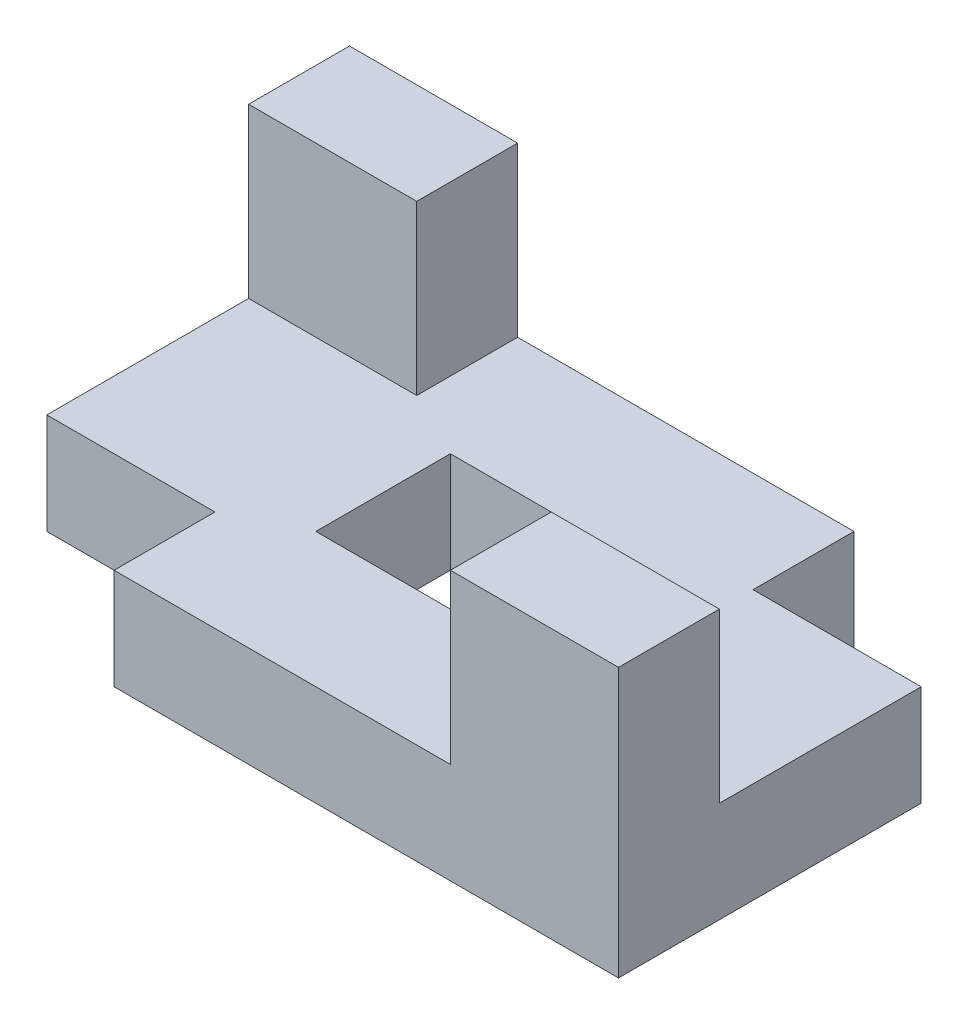
ISO-10303-21;
HEADER;
FILE_DESCRIPTION(('STEP AP214'),'2;1');
FILE_NAME('part.step','',(''),(''),'','','');
FILE_SCHEMA(('AUTOMOTIVE_DESIGN { 1 0 10303 214 1 1 1 1 }'));
ENDSEC;
DATA;
#1=APPLICATION_CONTEXT('core data for automotive mechanical design processes');
#2=APPLICATION_PROTOCOL_DEFINITION('international standard','automotive_design',2000,#1);
#3=PRODUCT_CONTEXT('',#1,'mechanical');
#4=PRODUCT('Part','Part','',(#3));
#5=PRODUCT_RELATED_PRODUCT_CATEGORY('part','',(#4));
#6=PRODUCT_DEFINITION_FORMATION('','',#4);
#7=PRODUCT_DEFINITION_CONTEXT('part definition',#1,'design');
#8=PRODUCT_DEFINITION('design','',#6,#7);
#9=PRODUCT_DEFINITION_SHAPE('','',#8);
#10=(LENGTH_UNIT() NAMED_UNIT(*) SI_UNIT(.MILLI.,.METRE.));
#11=(NAMED_UNIT(*) PLANE_ANGLE_UNIT() SI_UNIT($,.RADIAN.));
#12=(NAMED_UNIT(*) SI_UNIT($,.STERADIAN.) SOLID_ANGLE_UNIT());
#13=UNCERTAINTY_MEASURE_WITH_UNIT(LENGTH_MEASURE(1.E-05),#10,'distance_accuracy_value','');
#14=(GEOMETRIC_REPRESENTATION_CONTEXT(3) GLOBAL_UNCERTAINTY_ASSIGNED_CONTEXT((#13)) GLOBAL_UNIT_ASSIGNED_CONTEXT((#10,
#11,#12)) REPRESENTATION_CONTEXT('',''));
#15=CARTESIAN_POINT('',(0.,0.,0.));
#16=DIRECTION('',(0.,0.,1.));
#17=DIRECTION('',(1.,0.,0.));
#18=AXIS2_PLACEMENT_3D('',#15,#16,#17);
#19=CARTESIAN_POINT('',(50.,15.,0.));
#20=DIRECTION('',(-1.,0.,0.));
#21=DIRECTION('',(0.,0.,1.));
#22=AXIS2_PLACEMENT_3D('',#19,#20,#21);
#23=PLANE('',#22);
#24=DIRECTION('',(0.,0.,-1.));
#25=VECTOR('',#24,1.);
#26=CARTESIAN_POINT('',(50.,0.,0.));
#27=LINE('',#26,#25);
#28=CARTESIAN_POINT('',(50.,0.,30.));
#29=VERTEX_POINT('',#28);
#30=CARTESIAN_POINT('',(50.,0.,-15.));
#31=VERTEX_POINT('',#30);
#32=EDGE_CURVE('E196',#29,#31,#27,.T.);
#33=ORIENTED_EDGE('',*,*,#32,.T.);
#34=DIRECTION('',(0.,-1.,0.));
#35=VECTOR('',#34,1.);
#36=CARTESIAN_POINT('',(50.,15.,-15.));
#37=LINE('',#36,#35);
#38=CARTESIAN_POINT('',(50.,15.,-15.));
#39=VERTEX_POINT('',#38);
#40=EDGE_CURVE('E11',#39,#31,#37,.T.);
#41=ORIENTED_EDGE('',*,*,#40,.F.);
#42=DIRECTION('',(0.,0.,-1.));
#43=VECTOR('',#42,1.);
#44=CARTESIAN_POINT('',(50.,15.,0.));
#45=LINE('',#44,#43);
#46=CARTESIAN_POINT('',(50.,15.,15.));
#47=VERTEX_POINT('',#46);
#48=EDGE_CURVE('E274',#47,#39,#45,.T.);
#49=ORIENTED_EDGE('',*,*,#48,.F.);
#50=DIRECTION('',(0.,-1.,0.));
#51=VECTOR('',#50,1.);
#52=CARTESIAN_POINT('',(50.,40.,15.));
#53=LINE('',#52,#51);
#54=CARTESIAN_POINT('',(50.,40.,15.));
#55=VERTEX_POINT('',#54);
#56=EDGE_CURVE('E616',#55,#47,#53,.T.);
#57=ORIENTED_EDGE('',*,*,#56,.F.);
#58=DIRECTION('',(0.,0.,-1.));
#59=VECTOR('',#58,1.);
#60=CARTESIAN_POINT('',(50.,40.,0.));
#61=LINE('',#60,#59);
#62=CARTESIAN_POINT('',(50.,40.,30.));
#63=VERTEX_POINT('',#62);
#64=EDGE_CURVE('E564',#63,#55,#61,.T.);
#65=ORIENTED_EDGE('',*,*,#64,.F.);
#66=DIRECTION('',(0.,-1.,0.));
#67=VECTOR('',#66,1.);
#68=CARTESIAN_POINT('',(50.,40.,30.));
#69=LINE('',#68,#67);
#70=EDGE_CURVE('E583',#63,#29,#69,.T.);
#71=ORIENTED_EDGE('',*,*,#70,.T.);
#72=EDGE_LOOP('',(#33,#41,#49,#57,#65,#71));
#73=FACE_BOUND('',#72,.T.);
#74=ADVANCED_FACE('F45',(#73),#23,.F.);
#75=CARTESIAN_POINT('',(0.,15.,-15.));
#76=DIRECTION('',(0.,0.,1.));
#77=DIRECTION('',(1.,0.,0.));
#78=AXIS2_PLACEMENT_3D('',#75,#76,#77);
#79=PLANE('',#78);
#80=DIRECTION('',(-1.,0.,0.));
#81=VECTOR('',#80,1.);
#82=CARTESIAN_POINT('',(0.,0.,-15.));
#83=LINE('',#82,#81);
#84=CARTESIAN_POINT('',(25.,0.,-15.));
#85=VERTEX_POINT('',#84);
#86=EDGE_CURVE('E200',#31,#85,#83,.T.);
#87=ORIENTED_EDGE('',*,*,#86,.T.);
#88=DIRECTION('',(0.,-1.,0.));
#89=VECTOR('',#88,1.);
#90=CARTESIAN_POINT('',(25.,15.,-15.));
#91=LINE('',#90,#89);
#92=CARTESIAN_POINT('',(25.,15.,-15.));
#93=VERTEX_POINT('',#92);
#94=EDGE_CURVE('E56',#93,#85,#91,.T.);
#95=ORIENTED_EDGE('',*,*,#94,.F.);
#96=DIRECTION('',(-1.,0.,0.));
#97=VECTOR('',#96,1.);
#98=CARTESIAN_POINT('',(0.,15.,-15.));
#99=LINE('',#98,#97);
#100=EDGE_CURVE('E278',#39,#93,#99,.T.);
#101=ORIENTED_EDGE('',*,*,#100,.F.);
#102=ORIENTED_EDGE('',*,*,#40,.T.);
#103=EDGE_LOOP('',(#87,#95,#101,#102));
#104=FACE_BOUND('',#103,.T.);
#105=ADVANCED_FACE('F348',(#104),#79,.F.);
#106=CARTESIAN_POINT('',(25.,15.,0.));
#107=DIRECTION('',(1.,0.,0.));
#108=DIRECTION('',(0.,0.,-1.));
#109=AXIS2_PLACEMENT_3D('',#106,#107,#108);
#110=PLANE('',#109);
#111=DIRECTION('',(0.,0.,1.));
#112=VECTOR('',#111,1.);
#113=CARTESIAN_POINT('',(25.,0.,0.));
#114=LINE('',#113,#112);
#115=CARTESIAN_POINT('',(25.,0.,-30.));
#116=VERTEX_POINT('',#115);
#117=EDGE_CURVE('E204',#116,#85,#114,.T.);
#118=ORIENTED_EDGE('',*,*,#117,.F.);
#119=DIRECTION('',(0.,-1.,0.));
#120=VECTOR('',#119,1.);
#121=CARTESIAN_POINT('',(25.,15.,-30.));
#122=LINE('',#121,#120);
#123=CARTESIAN_POINT('',(25.,15.,-30.));
#124=VERTEX_POINT('',#123);
#125=EDGE_CURVE('E151',#124,#116,#122,.T.);
#126=ORIENTED_EDGE('',*,*,#125,.F.);
#127=DIRECTION('',(0.,0.,1.));
#128=VECTOR('',#127,1.);
#129=CARTESIAN_POINT('',(25.,15.,0.));
#130=LINE('',#129,#128);
#131=EDGE_CURVE('E281',#124,#93,#130,.T.);
#132=ORIENTED_EDGE('',*,*,#131,.T.);
#133=ORIENTED_EDGE('',*,*,#94,.T.);
#134=EDGE_LOOP('',(#118,#126,#132,#133));
#135=FACE_BOUND('',#134,.T.);
#136=ADVANCED_FACE('F315',(#135),#110,.T.);
#137=CARTESIAN_POINT('',(0.,15.,-30.));
#138=DIRECTION('',(0.,0.,-1.));
#139=DIRECTION('',(-1.,0.,0.));
#140=AXIS2_PLACEMENT_3D('',#137,#138,#139);
#141=PLANE('',#140);
#142=DIRECTION('',(1.,0.,0.));
#143=VECTOR('',#142,1.);
#144=CARTESIAN_POINT('',(0.,0.,-30.));
#145=LINE('',#144,#143);
#146=CARTESIAN_POINT('',(-50.,0.,-30.));
#147=VERTEX_POINT('',#146);
#148=EDGE_CURVE('E208',#147,#116,#145,.T.);
#149=ORIENTED_EDGE('',*,*,#148,.F.);
#150=DIRECTION('',(0.,-1.,0.));
#151=VECTOR('',#150,1.);
#152=CARTESIAN_POINT('',(-50.,40.,-30.));
#153=LINE('',#152,#151);
#154=CARTESIAN_POINT('',(-50.,40.,-30.));
#155=VERTEX_POINT('',#154);
#156=EDGE_CURVE('E309',#155,#147,#153,.T.);
#157=ORIENTED_EDGE('',*,*,#156,.F.);
#158=DIRECTION('',(1.,0.,0.));
#159=VECTOR('',#158,1.);
#160=CARTESIAN_POINT('',(0.,40.,-30.));
#161=LINE('',#160,#159);
#162=CARTESIAN_POINT('',(-25.,40.,-30.));
#163=VERTEX_POINT('',#162);
#164=EDGE_CURVE('E307',#155,#163,#161,.T.);
#165=ORIENTED_EDGE('',*,*,#164,.T.);
#166=DIRECTION('',(0.,-1.,0.));
#167=VECTOR('',#166,1.);
#168=CARTESIAN_POINT('',(-25.,40.,-30.));
#169=LINE('',#168,#167);
#170=CARTESIAN_POINT('',(-25.,15.,-30.));
#171=VERTEX_POINT('',#170);
#172=EDGE_CURVE('E298',#163,#171,#169,.T.);
#173=ORIENTED_EDGE('',*,*,#172,.T.);
#174=DIRECTION('',(1.,0.,0.));
#175=VECTOR('',#174,1.);
#176=CARTESIAN_POINT('',(0.,15.,-30.));
#177=LINE('',#176,#175);
#178=EDGE_CURVE('E285',#171,#124,#177,.T.);
#179=ORIENTED_EDGE('',*,*,#178,.T.);
#180=ORIENTED_EDGE('',*,*,#125,.T.);
#181=EDGE_LOOP('',(#149,#157,#165,#173,#179,#180));
#182=FACE_BOUND('',#181,.T.);
#183=ADVANCED_FACE('F304',(#182),#141,.T.);
#184=CARTESIAN_POINT('',(-50.,15.,0.));
#185=DIRECTION('',(-1.,0.,0.));
#186=DIRECTION('',(0.,0.,1.));
#187=AXIS2_PLACEMENT_3D('',#184,#185,#186);
#188=PLANE('',#187);
#189=DIRECTION('',(0.,0.,-1.));
#190=VECTOR('',#189,1.);
#191=CARTESIAN_POINT('',(-50.,0.,0.));
#192=LINE('',#191,#190);
#193=CARTESIAN_POINT('',(-50.,0.,15.));
#194=VERTEX_POINT('',#193);
#195=EDGE_CURVE('E147',#194,#147,#192,.T.);
#196=ORIENTED_EDGE('',*,*,#195,.F.);
#197=DIRECTION('',(0.,-1.,0.));
#198=VECTOR('',#197,1.);
#199=CARTESIAN_POINT('',(-50.,15.,15.));
#200=LINE('',#199,#198);
#201=CARTESIAN_POINT('',(-50.,15.,15.));
#202=VERTEX_POINT('',#201);
#203=EDGE_CURVE('E138',#202,#194,#200,.T.);
#204=ORIENTED_EDGE('',*,*,#203,.F.);
#205=DIRECTION('',(0.,0.,-1.));
#206=VECTOR('',#205,1.);
#207=CARTESIAN_POINT('',(-50.,15.,0.));
#208=LINE('',#207,#206);
#209=CARTESIAN_POINT('',(-50.,15.,-15.));
#210=VERTEX_POINT('',#209);
#211=EDGE_CURVE('E144',#202,#210,#208,.T.);
#212=ORIENTED_EDGE('',*,*,#211,.T.);
#213=DIRECTION('',(0.,-1.,0.));
#214=VECTOR('',#213,1.);
#215=CARTESIAN_POINT('',(-50.,40.,-15.));
#216=LINE('',#215,#214);
#217=CARTESIAN_POINT('',(-50.,40.,-15.));
#218=VERTEX_POINT('',#217);
#219=EDGE_CURVE('E325',#218,#210,#216,.T.);
#220=ORIENTED_EDGE('',*,*,#219,.F.);
#221=DIRECTION('',(0.,0.,-1.));
#222=VECTOR('',#221,1.);
#223=CARTESIAN_POINT('',(-50.,40.,0.));
#224=LINE('',#223,#222);
#225=EDGE_CURVE('E323',#218,#155,#224,.T.);
#226=ORIENTED_EDGE('',*,*,#225,.T.);
#227=ORIENTED_EDGE('',*,*,#156,.T.);
#228=EDGE_LOOP('',(#196,#204,#212,#220,#226,#227));
#229=FACE_BOUND('',#228,.T.);
#230=ADVANCED_FACE('F140',(#229),#188,.T.);
#231=CARTESIAN_POINT('',(0.,15.,15.));
#232=DIRECTION('',(0.,0.,-1.));
#233=DIRECTION('',(-1.,0.,0.));
#234=AXIS2_PLACEMENT_3D('',#231,#232,#233);
#235=PLANE('',#234);
#236=DIRECTION('',(1.,0.,0.));
#237=VECTOR('',#236,1.);
#238=CARTESIAN_POINT('',(0.,0.,15.));
#239=LINE('',#238,#237);
#240=CARTESIAN_POINT('',(-25.,0.,15.));
#241=VERTEX_POINT('',#240);
#242=EDGE_CURVE('E214',#194,#241,#239,.T.);
#243=ORIENTED_EDGE('',*,*,#242,.T.);
#244=DIRECTION('',(0.,-1.,0.));
#245=VECTOR('',#244,1.);
#246=CARTESIAN_POINT('',(-25.,15.,15.));
#247=LINE('',#246,#245);
#248=CARTESIAN_POINT('',(-25.,15.,15.));
#249=VERTEX_POINT('',#248);
#250=EDGE_CURVE('E152',#249,#241,#247,.T.);
#251=ORIENTED_EDGE('',*,*,#250,.F.);
#252=DIRECTION('',(1.,0.,0.));
#253=VECTOR('',#252,1.);
#254=CARTESIAN_POINT('',(0.,15.,15.));
#255=LINE('',#254,#253);
#256=EDGE_CURVE('E156',#202,#249,#255,.T.);
#257=ORIENTED_EDGE('',*,*,#256,.F.);
#258=ORIENTED_EDGE('',*,*,#203,.T.);
#259=EDGE_LOOP('',(#243,#251,#257,#258));
#260=FACE_BOUND('',#259,.T.);
#261=ADVANCED_FACE('F157',(#260),#235,.F.);
#262=CARTESIAN_POINT('',(-25.,15.,0.));
#263=DIRECTION('',(1.,0.,0.));
#264=DIRECTION('',(0.,0.,-1.));
#265=AXIS2_PLACEMENT_3D('',#262,#263,#264);
#266=PLANE('',#265);
#267=DIRECTION('',(0.,0.,1.));
#268=VECTOR('',#267,1.);
#269=CARTESIAN_POINT('',(-25.,0.,0.));
#270=LINE('',#269,#268);
#271=CARTESIAN_POINT('',(-25.,0.,30.));
#272=VERTEX_POINT('',#271);
#273=EDGE_CURVE('E102',#241,#272,#270,.T.);
#274=ORIENTED_EDGE('',*,*,#273,.T.);
#275=DIRECTION('',(0.,-1.,0.));
#276=VECTOR('',#275,1.);
#277=CARTESIAN_POINT('',(-25.,15.,30.));
#278=LINE('',#277,#276);
#279=CARTESIAN_POINT('',(-25.,15.,30.));
#280=VERTEX_POINT('',#279);
#281=EDGE_CURVE('E222',#280,#272,#278,.T.);
#282=ORIENTED_EDGE('',*,*,#281,.F.);
#283=DIRECTION('',(0.,0.,1.));
#284=VECTOR('',#283,1.);
#285=CARTESIAN_POINT('',(-25.,15.,0.));
#286=LINE('',#285,#284);
#287=EDGE_CURVE('E160',#249,#280,#286,.T.);
#288=ORIENTED_EDGE('',*,*,#287,.F.);
#289=ORIENTED_EDGE('',*,*,#250,.T.);
#290=EDGE_LOOP('',(#274,#282,#288,#289));
#291=FACE_BOUND('',#290,.T.);
#292=ADVANCED_FACE('F365',(#291),#266,.F.);
#293=CARTESIAN_POINT('',(15.,15.,0.));
#294=DIRECTION('',(-1.,0.,0.));
#295=DIRECTION('',(0.,0.,1.));
#296=AXIS2_PLACEMENT_3D('',#293,#294,#295);
#297=PLANE('',#296);
#298=DIRECTION('',(0.,0.,-1.));
#299=VECTOR('',#298,1.);
#300=CARTESIAN_POINT('',(15.,0.,0.));
#301=LINE('',#300,#299);
#302=CARTESIAN_POINT('',(15.,0.,9.99999999999999));
#303=VERTEX_POINT('',#302);
#304=CARTESIAN_POINT('',(15.,0.,-10.));
#305=VERTEX_POINT('',#304);
#306=EDGE_CURVE('E180',#303,#305,#301,.T.);
#307=ORIENTED_EDGE('',*,*,#306,.F.);
#308=DIRECTION('',(0.,-1.,0.));
#309=VECTOR('',#308,1.);
#310=CARTESIAN_POINT('',(15.,15.,9.99999999999999));
#311=LINE('',#310,#309);
#312=CARTESIAN_POINT('',(15.,15.,9.99999999999999));
#313=VERTEX_POINT('',#312);
#314=EDGE_CURVE('E49',#313,#303,#311,.T.);
#315=ORIENTED_EDGE('',*,*,#314,.F.);
#316=DIRECTION('',(0.,0.,-1.));
#317=VECTOR('',#316,1.);
#318=CARTESIAN_POINT('',(15.,15.,0.));
#319=LINE('',#318,#317);
#320=CARTESIAN_POINT('',(15.,15.,-10.));
#321=VERTEX_POINT('',#320);
#322=EDGE_CURVE('E221',#313,#321,#319,.T.);
#323=ORIENTED_EDGE('',*,*,#322,.T.);
#324=DIRECTION('',(0.,-1.,0.));
#325=VECTOR('',#324,1.);
#326=CARTESIAN_POINT('',(15.,15.,-10.));
#327=LINE('',#326,#325);
#328=EDGE_CURVE('E179',#321,#305,#327,.T.);
#329=ORIENTED_EDGE('',*,*,#328,.T.);
#330=EDGE_LOOP('',(#307,#315,#323,#329));
#331=FACE_BOUND('',#330,.T.);
#332=ADVANCED_FACE('F47',(#331),#297,.T.);
#333=CARTESIAN_POINT('',(0.,15.,9.99999999999999));
#334=DIRECTION('',(0.,0.,-1.));
#335=DIRECTION('',(-1.,0.,0.));
#336=AXIS2_PLACEMENT_3D('',#333,#334,#335);
#337=PLANE('',#336);
#338=DIRECTION('',(1.,0.,0.));
#339=VECTOR('',#338,1.);
#340=CARTESIAN_POINT('',(0.,0.,9.99999999999999));
#341=LINE('',#340,#339);
#342=CARTESIAN_POINT('',(-15.,0.,9.99999999999999));
#343=VERTEX_POINT('',#342);
#344=EDGE_CURVE('E184',#343,#303,#341,.T.);
#345=ORIENTED_EDGE('',*,*,#344,.F.);
#346=DIRECTION('',(0.,-1.,0.));
#347=VECTOR('',#346,1.);
#348=CARTESIAN_POINT('',(-15.,15.,9.99999999999999));
#349=LINE('',#348,#347);
#350=CARTESIAN_POINT('',(-15.,15.,9.99999999999999));
#351=VERTEX_POINT('',#350);
#352=EDGE_CURVE('E236',#351,#343,#349,.T.);
#353=ORIENTED_EDGE('',*,*,#352,.F.);
#354=DIRECTION('',(1.,0.,0.));
#355=VECTOR('',#354,1.);
#356=CARTESIAN_POINT('',(0.,15.,9.99999999999999));
#357=LINE('',#356,#355);
#358=EDGE_CURVE('E247',#351,#313,#357,.T.);
#359=ORIENTED_EDGE('',*,*,#358,.T.);
#360=ORIENTED_EDGE('',*,*,#314,.T.);
#361=EDGE_LOOP('',(#345,#353,#359,#360));
#362=FACE_BOUND('',#361,.T.);
#363=ADVANCED_FACE('F245',(#362),#337,.T.);
#364=CARTESIAN_POINT('',(-15.,15.,0.));
#365=DIRECTION('',(-1.,0.,0.));
#366=DIRECTION('',(0.,0.,1.));
#367=AXIS2_PLACEMENT_3D('',#364,#365,#366);
#368=PLANE('',#367);
#369=DIRECTION('',(0.,0.,-1.));
#370=VECTOR('',#369,1.);
#371=CARTESIAN_POINT('',(-15.,0.,0.));
#372=LINE('',#371,#370);
#373=CARTESIAN_POINT('',(-15.,0.,-10.));
#374=VERTEX_POINT('',#373);
#375=EDGE_CURVE('E189',#343,#374,#372,.T.);
#376=ORIENTED_EDGE('',*,*,#375,.T.);
#377=DIRECTION('',(0.,-1.,0.));
#378=VECTOR('',#377,1.);
#379=CARTESIAN_POINT('',(-15.,15.,-10.));
#380=LINE('',#379,#378);
#381=CARTESIAN_POINT('',(-15.,15.,-10.));
#382=VERTEX_POINT('',#381);
#383=EDGE_CURVE('E233',#382,#374,#380,.T.);
#384=ORIENTED_EDGE('',*,*,#383,.F.);
#385=DIRECTION('',(0.,0.,-1.));
#386=VECTOR('',#385,1.);
#387=CARTESIAN_POINT('',(-15.,15.,0.));
#388=LINE('',#387,#386);
#389=EDGE_CURVE('E261',#351,#382,#388,.T.);
#390=ORIENTED_EDGE('',*,*,#389,.F.);
#391=ORIENTED_EDGE('',*,*,#352,.T.);
#392=EDGE_LOOP('',(#376,#384,#390,#391));
#393=FACE_BOUND('',#392,.T.);
#394=ADVANCED_FACE('F253',(#393),#368,.F.);
#395=CARTESIAN_POINT('',(0.,15.,-10.));
#396=DIRECTION('',(0.,0.,-1.));
#397=DIRECTION('',(-1.,0.,0.));
#398=AXIS2_PLACEMENT_3D('',#395,#396,#397);
#399=PLANE('',#398);
#400=DIRECTION('',(1.,0.,0.));
#401=VECTOR('',#400,1.);
#402=CARTESIAN_POINT('',(0.,0.,-10.));
#403=LINE('',#402,#401);
#404=EDGE_CURVE('E192',#374,#305,#403,.T.);
#405=ORIENTED_EDGE('',*,*,#404,.T.);
#406=ORIENTED_EDGE('',*,*,#328,.F.);
#407=DIRECTION('',(1.,0.,0.));
#408=VECTOR('',#407,1.);
#409=CARTESIAN_POINT('',(0.,15.,-10.));
#410=LINE('',#409,#408);
#411=EDGE_CURVE('E257',#382,#321,#410,.T.);
#412=ORIENTED_EDGE('',*,*,#411,.F.);
#413=ORIENTED_EDGE('',*,*,#383,.T.);
#414=EDGE_LOOP('',(#405,#406,#412,#413));
#415=FACE_BOUND('',#414,.T.);
#416=ADVANCED_FACE('F256',(#415),#399,.F.);
#417=CARTESIAN_POINT('',(0.,15.,30.));
#418=DIRECTION('',(0.,0.,-1.));
#419=DIRECTION('',(-1.,0.,0.));
#420=AXIS2_PLACEMENT_3D('',#417,#418,#419);
#421=PLANE('',#420);
#422=DIRECTION('',(1.,0.,0.));
#423=VECTOR('',#422,1.);
#424=CARTESIAN_POINT('',(0.,0.,30.));
#425=LINE('',#424,#423);
#426=EDGE_CURVE('E107',#272,#29,#425,.T.);
#427=ORIENTED_EDGE('',*,*,#426,.T.);
#428=ORIENTED_EDGE('',*,*,#70,.F.);
#429=DIRECTION('',(1.,0.,0.));
#430=VECTOR('',#429,1.);
#431=CARTESIAN_POINT('',(0.,40.,30.));
#432=LINE('',#431,#430);
#433=CARTESIAN_POINT('',(25.,40.,30.));
#434=VERTEX_POINT('',#433);
#435=EDGE_CURVE('E610',#434,#63,#432,.T.);
#436=ORIENTED_EDGE('',*,*,#435,.F.);
#437=DIRECTION('',(0.,-1.,0.));
#438=VECTOR('',#437,1.);
#439=CARTESIAN_POINT('',(25.,40.,30.));
#440=LINE('',#439,#438);
#441=CARTESIAN_POINT('',(25.,15.,30.));
#442=VERTEX_POINT('',#441);
#443=EDGE_CURVE('E576',#434,#442,#440,.T.);
#444=ORIENTED_EDGE('',*,*,#443,.T.);
#445=DIRECTION('',(1.,0.,0.));
#446=VECTOR('',#445,1.);
#447=CARTESIAN_POINT('',(0.,15.,30.));
#448=LINE('',#447,#446);
#449=EDGE_CURVE('E65',#280,#442,#448,.T.);
#450=ORIENTED_EDGE('',*,*,#449,.F.);
#451=ORIENTED_EDGE('',*,*,#281,.T.);
#452=EDGE_LOOP('',(#427,#428,#436,#444,#450,#451));
#453=FACE_BOUND('',#452,.T.);
#454=ADVANCED_FACE('F337',(#453),#421,.F.);
#455=CARTESIAN_POINT('',(0.,15.,0.));
#456=DIRECTION('',(0.,1.,0.));
#457=DIRECTION('',(0.,0.,1.));
#458=AXIS2_PLACEMENT_3D('',#455,#456,#457);
#459=PLANE('',#458);
#460=ORIENTED_EDGE('',*,*,#322,.F.);
#461=ORIENTED_EDGE('',*,*,#358,.F.);
#462=ORIENTED_EDGE('',*,*,#389,.T.);
#463=ORIENTED_EDGE('',*,*,#411,.T.);
#464=EDGE_LOOP('',(#460,#461,#462,#463));
#465=FACE_BOUND('',#464,.T.);
#466=DIRECTION('',(0.,0.,1.));
#467=VECTOR('',#466,1.);
#468=CARTESIAN_POINT('',(25.,15.,0.));
#469=LINE('',#468,#467);
#470=CARTESIAN_POINT('',(25.,15.,15.));
#471=VERTEX_POINT('',#470);
#472=EDGE_CURVE('E260',#471,#442,#469,.T.);
#473=ORIENTED_EDGE('',*,*,#472,.F.);
#474=DIRECTION('',(-1.,0.,0.));
#475=VECTOR('',#474,1.);
#476=CARTESIAN_POINT('',(0.,15.,15.));
#477=LINE('',#476,#475);
#478=EDGE_CURVE('E266',#47,#471,#477,.T.);
#479=ORIENTED_EDGE('',*,*,#478,.F.);
#480=ORIENTED_EDGE('',*,*,#48,.T.);
#481=ORIENTED_EDGE('',*,*,#100,.T.);
#482=ORIENTED_EDGE('',*,*,#131,.F.);
#483=ORIENTED_EDGE('',*,*,#178,.F.);
#484=DIRECTION('',(0.,0.,-1.));
#485=VECTOR('',#484,1.);
#486=CARTESIAN_POINT('',(-25.,15.,0.));
#487=LINE('',#486,#485);
#488=CARTESIAN_POINT('',(-25.,15.,-15.));
#489=VERTEX_POINT('',#488);
#490=EDGE_CURVE('E171',#489,#171,#487,.T.);
#491=ORIENTED_EDGE('',*,*,#490,.F.);
#492=DIRECTION('',(1.,0.,0.));
#493=VECTOR('',#492,1.);
#494=CARTESIAN_POINT('',(0.,15.,-15.));
#495=LINE('',#494,#493);
#496=EDGE_CURVE('E167',#210,#489,#495,.T.);
#497=ORIENTED_EDGE('',*,*,#496,.F.);
#498=ORIENTED_EDGE('',*,*,#211,.F.);
#499=ORIENTED_EDGE('',*,*,#256,.T.);
#500=ORIENTED_EDGE('',*,*,#287,.T.);
#501=ORIENTED_EDGE('',*,*,#449,.T.);
#502=EDGE_LOOP('',(#473,#479,#480,#481,#482,#483,#491,#497,#498,#499,#500,#501));
#503=FACE_BOUND('',#502,.T.);
#504=ADVANCED_FACE('F164',(#465,#503),#459,.T.);
#505=CARTESIAN_POINT('',(0.,0.,0.));
#506=DIRECTION('',(0.,1.,0.));
#507=DIRECTION('',(0.,0.,1.));
#508=AXIS2_PLACEMENT_3D('',#505,#506,#507);
#509=PLANE('',#508);
#510=ORIENTED_EDGE('',*,*,#306,.T.);
#511=ORIENTED_EDGE('',*,*,#404,.F.);
#512=ORIENTED_EDGE('',*,*,#375,.F.);
#513=ORIENTED_EDGE('',*,*,#344,.T.);
#514=EDGE_LOOP('',(#510,#511,#512,#513));
#515=FACE_BOUND('',#514,.T.);
#516=ORIENTED_EDGE('',*,*,#32,.F.);
#517=ORIENTED_EDGE('',*,*,#426,.F.);
#518=ORIENTED_EDGE('',*,*,#273,.F.);
#519=ORIENTED_EDGE('',*,*,#242,.F.);
#520=ORIENTED_EDGE('',*,*,#195,.T.);
#521=ORIENTED_EDGE('',*,*,#148,.T.);
#522=ORIENTED_EDGE('',*,*,#117,.T.);
#523=ORIENTED_EDGE('',*,*,#86,.F.);
#524=EDGE_LOOP('',(#516,#517,#518,#519,#520,#521,#522,#523));
#525=FACE_BOUND('',#524,.T.);
#526=ADVANCED_FACE('F251',(#515,#525),#509,.F.);
#527=CARTESIAN_POINT('',(0.,40.,-15.));
#528=DIRECTION('',(0.,0.,-1.));
#529=DIRECTION('',(-1.,0.,0.));
#530=AXIS2_PLACEMENT_3D('',#527,#528,#529);
#531=PLANE('',#530);
#532=ORIENTED_EDGE('',*,*,#496,.T.);
#533=DIRECTION('',(0.,-1.,0.));
#534=VECTOR('',#533,1.);
#535=CARTESIAN_POINT('',(-25.,40.,-15.));
#536=LINE('',#535,#534);
#537=CARTESIAN_POINT('',(-25.,40.,-15.));
#538=VERTEX_POINT('',#537);
#539=EDGE_CURVE('E185',#538,#489,#536,.T.);
#540=ORIENTED_EDGE('',*,*,#539,.F.);
#541=DIRECTION('',(1.,0.,0.));
#542=VECTOR('',#541,1.);
#543=CARTESIAN_POINT('',(0.,40.,-15.));
#544=LINE('',#543,#542);
#545=EDGE_CURVE('E575',#218,#538,#544,.T.);
#546=ORIENTED_EDGE('',*,*,#545,.F.);
#547=ORIENTED_EDGE('',*,*,#219,.T.);
#548=EDGE_LOOP('',(#532,#540,#546,#547));
#549=FACE_BOUND('',#548,.T.);
#550=ADVANCED_FACE('F343',(#549),#531,.F.);
#551=CARTESIAN_POINT('',(-25.,40.,0.));
#552=DIRECTION('',(-1.,0.,0.));
#553=DIRECTION('',(0.,0.,1.));
#554=AXIS2_PLACEMENT_3D('',#551,#552,#553);
#555=PLANE('',#554);
#556=ORIENTED_EDGE('',*,*,#490,.T.);
#557=ORIENTED_EDGE('',*,*,#172,.F.);
#558=DIRECTION('',(0.,0.,-1.));
#559=VECTOR('',#558,1.);
#560=CARTESIAN_POINT('',(-25.,40.,0.));
#561=LINE('',#560,#559);
#562=EDGE_CURVE('E581',#538,#163,#561,.T.);
#563=ORIENTED_EDGE('',*,*,#562,.F.);
#564=ORIENTED_EDGE('',*,*,#539,.T.);
#565=EDGE_LOOP('',(#556,#557,#563,#564));
#566=FACE_BOUND('',#565,.T.);
#567=ADVANCED_FACE('F295',(#566),#555,.F.);
#568=CARTESIAN_POINT('',(0.,40.,0.));
#569=DIRECTION('',(0.,1.,0.));
#570=DIRECTION('',(0.,0.,1.));
#571=AXIS2_PLACEMENT_3D('',#568,#569,#570);
#572=PLANE('',#571);
#573=ORIENTED_EDGE('',*,*,#545,.T.);
#574=ORIENTED_EDGE('',*,*,#562,.T.);
#575=ORIENTED_EDGE('',*,*,#164,.F.);
#576=ORIENTED_EDGE('',*,*,#225,.F.);
#577=EDGE_LOOP('',(#573,#574,#575,#576));
#578=FACE_BOUND('',#577,.T.);
#579=ADVANCED_FACE('F497',(#578),#572,.T.);
#580=CARTESIAN_POINT('',(0.,40.,15.));
#581=DIRECTION('',(0.,0.,1.));
#582=DIRECTION('',(1.,0.,0.));
#583=AXIS2_PLACEMENT_3D('',#580,#581,#582);
#584=PLANE('',#583);
#585=ORIENTED_EDGE('',*,*,#478,.T.);
#586=DIRECTION('',(0.,-1.,0.));
#587=VECTOR('',#586,1.);
#588=CARTESIAN_POINT('',(25.,40.,15.));
#589=LINE('',#588,#587);
#590=CARTESIAN_POINT('',(25.,40.,15.));
#591=VERTEX_POINT('',#590);
#592=EDGE_CURVE('E572',#591,#471,#589,.T.);
#593=ORIENTED_EDGE('',*,*,#592,.F.);
#594=DIRECTION('',(-1.,0.,0.));
#595=VECTOR('',#594,1.);
#596=CARTESIAN_POINT('',(0.,40.,15.));
#597=LINE('',#596,#595);
#598=EDGE_CURVE('E555',#55,#591,#597,.T.);
#599=ORIENTED_EDGE('',*,*,#598,.F.);
#600=ORIENTED_EDGE('',*,*,#56,.T.);
#601=EDGE_LOOP('',(#585,#593,#599,#600));
#602=FACE_BOUND('',#601,.T.);
#603=ADVANCED_FACE('F507',(#602),#584,.F.);
#604=CARTESIAN_POINT('',(25.,40.,0.));
#605=DIRECTION('',(1.,0.,0.));
#606=DIRECTION('',(0.,0.,-1.));
#607=AXIS2_PLACEMENT_3D('',#604,#605,#606);
#608=PLANE('',#607);
#609=ORIENTED_EDGE('',*,*,#472,.T.);
#610=ORIENTED_EDGE('',*,*,#443,.F.);
#611=DIRECTION('',(0.,0.,1.));
#612=VECTOR('',#611,1.);
#613=CARTESIAN_POINT('',(25.,40.,0.));
#614=LINE('',#613,#612);
#615=EDGE_CURVE('E560',#591,#434,#614,.T.);
#616=ORIENTED_EDGE('',*,*,#615,.F.);
#617=ORIENTED_EDGE('',*,*,#592,.T.);
#618=EDGE_LOOP('',(#609,#610,#616,#617));
#619=FACE_BOUND('',#618,.T.);
#620=ADVANCED_FACE('F518',(#619),#608,.F.);
#621=CARTESIAN_POINT('',(0.,40.,0.));
#622=DIRECTION('',(0.,1.,0.));
#623=DIRECTION('',(0.,0.,1.));
#624=AXIS2_PLACEMENT_3D('',#621,#622,#623);
#625=PLANE('',#624);
#626=ORIENTED_EDGE('',*,*,#598,.T.);
#627=ORIENTED_EDGE('',*,*,#615,.T.);
#628=ORIENTED_EDGE('',*,*,#435,.T.);
#629=ORIENTED_EDGE('',*,*,#64,.T.);
#630=EDGE_LOOP('',(#626,#627,#628,#629));
#631=FACE_BOUND('',#630,.T.);
#632=ADVANCED_FACE('F529',(#631),#625,.T.);
#633=CLOSED_SHELL('',(#74,#105,#136,#183,#230,#261,#292,#332,#363,#394,#416,#454,#504,#526,#550,
#567,#579,#603,#620,#632));
#634=MANIFOLD_SOLID_BREP('B2',#633);
#635=ADVANCED_BREP_SHAPE_REPRESENTATION('',(#18,#634),#14);
#636=SHAPE_DEFINITION_REPRESENTATION(#9,#635);
ENDSEC;
END-ISO-10303-21;
